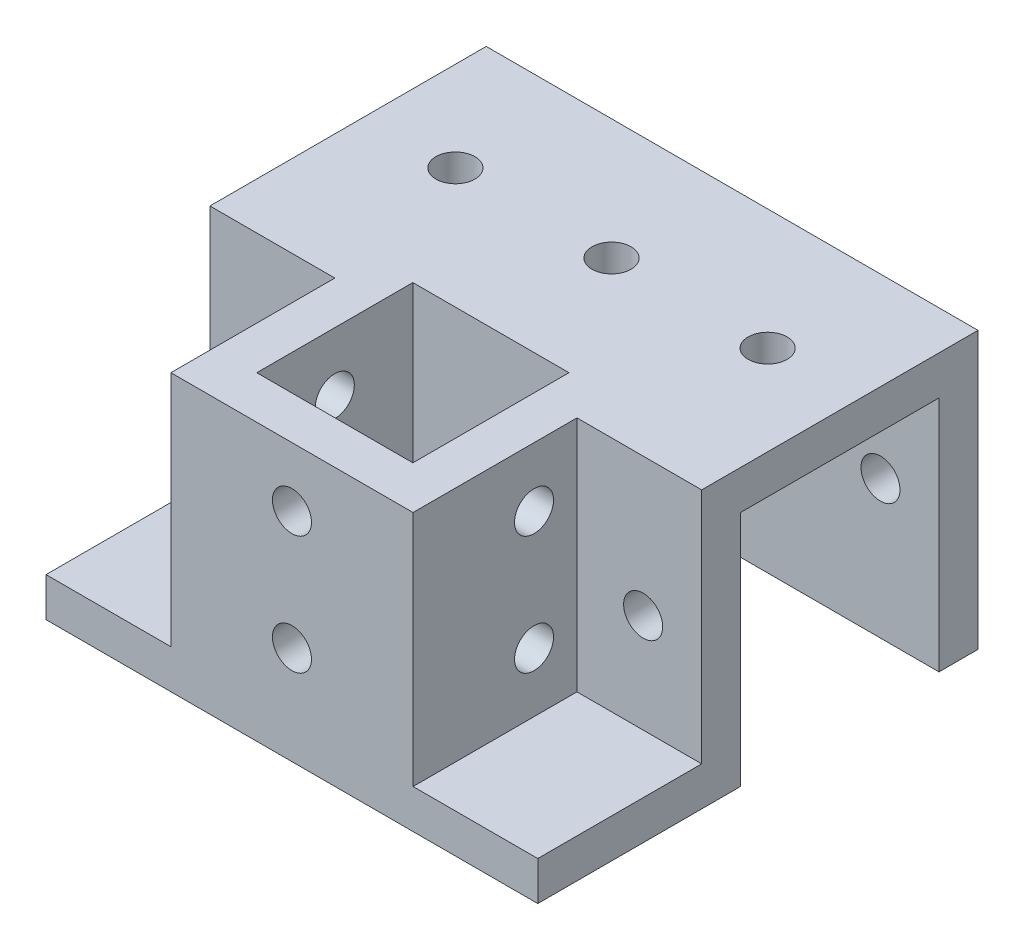
ISO-10303-21;
HEADER;
FILE_DESCRIPTION(('STEP AP214'),'2;1');
FILE_NAME('part.step','',(''),(''),'','','');
FILE_SCHEMA(('AUTOMOTIVE_DESIGN { 1 0 10303 214 1 1 1 1 }'));
ENDSEC;
DATA;
#1=APPLICATION_CONTEXT('core data for automotive mechanical design processes');
#2=APPLICATION_PROTOCOL_DEFINITION('international standard','automotive_design',2000,#1);
#3=PRODUCT_CONTEXT('',#1,'mechanical');
#4=PRODUCT('Part','Part','',(#3));
#5=PRODUCT_RELATED_PRODUCT_CATEGORY('part','',(#4));
#6=PRODUCT_DEFINITION_FORMATION('','',#4);
#7=PRODUCT_DEFINITION_CONTEXT('part definition',#1,'design');
#8=PRODUCT_DEFINITION('design','',#6,#7);
#9=PRODUCT_DEFINITION_SHAPE('','',#8);
#10=(LENGTH_UNIT() NAMED_UNIT(*) SI_UNIT(.MILLI.,.METRE.));
#11=(NAMED_UNIT(*) PLANE_ANGLE_UNIT() SI_UNIT($,.RADIAN.));
#12=(NAMED_UNIT(*) SI_UNIT($,.STERADIAN.) SOLID_ANGLE_UNIT());
#13=UNCERTAINTY_MEASURE_WITH_UNIT(LENGTH_MEASURE(1.E-05),#10,'distance_accuracy_value','');
#14=(GEOMETRIC_REPRESENTATION_CONTEXT(3) GLOBAL_UNCERTAINTY_ASSIGNED_CONTEXT((#13)) GLOBAL_UNIT_ASSIGNED_CONTEXT((#10,
#11,#12)) REPRESENTATION_CONTEXT('',''));
#15=CARTESIAN_POINT('',(0.,0.,0.));
#16=DIRECTION('',(0.,0.,1.));
#17=DIRECTION('',(1.,0.,0.));
#18=AXIS2_PLACEMENT_3D('',#15,#16,#17);
#19=CARTESIAN_POINT('',(21.,12.7,12.7));
#20=DIRECTION('',(0.,0.,1.));
#21=DIRECTION('',(0.,-1.,0.));
#22=AXIS2_PLACEMENT_3D('',#19,#20,#21);
#23=PLANE('',#22);
#24=DIRECTION('',(0.,1.,0.));
#25=VECTOR('',#24,1.);
#26=CARTESIAN_POINT('',(-42.,-17.7,12.7));
#27=LINE('',#26,#25);
#28=CARTESIAN_POINT('',(-42.,-17.7,12.7));
#29=VERTEX_POINT('',#28);
#30=CARTESIAN_POINT('',(-42.,12.7,12.7));
#31=VERTEX_POINT('',#30);
#32=EDGE_CURVE('E384',#29,#31,#27,.T.);
#33=ORIENTED_EDGE('',*,*,#32,.T.);
#34=DIRECTION('',(-1.,0.,0.));
#35=VECTOR('',#34,1.);
#36=CARTESIAN_POINT('',(21.,12.7,12.7));
#37=LINE('',#36,#35);
#38=CARTESIAN_POINT('',(21.,12.7,12.7));
#39=VERTEX_POINT('',#38);
#40=EDGE_CURVE('E242',#39,#31,#37,.T.);
#41=ORIENTED_EDGE('',*,*,#40,.F.);
#42=DIRECTION('',(0.,1.,0.));
#43=VECTOR('',#42,1.);
#44=CARTESIAN_POINT('',(21.,-12.7,12.7));
#45=LINE('',#44,#43);
#46=CARTESIAN_POINT('',(21.,-17.7,12.7));
#47=VERTEX_POINT('',#46);
#48=EDGE_CURVE('E239',#47,#39,#45,.T.);
#49=ORIENTED_EDGE('',*,*,#48,.F.);
#50=DIRECTION('',(-1.,0.,0.));
#51=VECTOR('',#50,1.);
#52=CARTESIAN_POINT('',(21.,-17.7,12.7));
#53=LINE('',#52,#51);
#54=EDGE_CURVE('E244',#47,#29,#53,.T.);
#55=ORIENTED_EDGE('',*,*,#54,.T.);
#56=EDGE_LOOP('',(#33,#41,#49,#55));
#57=FACE_BOUND('',#56,.T.);
#58=CARTESIAN_POINT('',(-34.5,0.,12.7));
#59=DIRECTION('',(0.,0.,1.));
#60=DIRECTION('',(0.,-1.,0.));
#61=AXIS2_PLACEMENT_3D('',#58,#59,#60);
#62=CIRCLE('',#61,2.5);
#63=CARTESIAN_POINT('',(-34.5,-2.50000000000001,12.7));
#64=VERTEX_POINT('',#63);
#65=EDGE_CURVE('E265',#64,#64,#62,.F.);
#66=ORIENTED_EDGE('',*,*,#65,.F.);
#67=EDGE_LOOP('',(#66));
#68=FACE_BOUND('',#67,.T.);
#69=CARTESIAN_POINT('',(13.5,0.,12.7));
#70=DIRECTION('',(0.,0.,1.));
#71=DIRECTION('',(0.,-1.,0.));
#72=AXIS2_PLACEMENT_3D('',#69,#70,#71);
#73=CIRCLE('',#72,2.5);
#74=CARTESIAN_POINT('',(13.5,-2.5,12.7));
#75=VERTEX_POINT('',#74);
#76=EDGE_CURVE('E280',#75,#75,#73,.T.);
#77=ORIENTED_EDGE('',*,*,#76,.T.);
#78=EDGE_LOOP('',(#77));
#79=FACE_BOUND('',#78,.T.);
#80=ADVANCED_FACE('F77',(#57,#68,#79),#23,.F.);
#81=CARTESIAN_POINT('',(21.,17.7,-17.7));
#82=DIRECTION('',(0.,0.,1.));
#83=DIRECTION('',(0.,-1.,0.));
#84=AXIS2_PLACEMENT_3D('',#81,#82,#83);
#85=PLANE('',#84);
#86=DIRECTION('',(-1.,0.,0.));
#87=VECTOR('',#86,1.);
#88=CARTESIAN_POINT('',(21.,-17.7,-17.7));
#89=LINE('',#88,#87);
#90=CARTESIAN_POINT('',(21.,-17.7,-17.7));
#91=VERTEX_POINT('',#90);
#92=CARTESIAN_POINT('',(-42.,-17.7,-17.7));
#93=VERTEX_POINT('',#92);
#94=EDGE_CURVE('E12',#91,#93,#89,.T.);
#95=ORIENTED_EDGE('',*,*,#94,.T.);
#96=DIRECTION('',(0.,1.,0.));
#97=VECTOR('',#96,1.);
#98=CARTESIAN_POINT('',(-42.,12.7,-17.7));
#99=LINE('',#98,#97);
#100=CARTESIAN_POINT('',(-42.,17.7,-17.7));
#101=VERTEX_POINT('',#100);
#102=EDGE_CURVE('E358',#93,#101,#99,.T.);
#103=ORIENTED_EDGE('',*,*,#102,.T.);
#104=DIRECTION('',(-1.,0.,0.));
#105=VECTOR('',#104,1.);
#106=CARTESIAN_POINT('',(21.,17.7,-17.7));
#107=LINE('',#106,#105);
#108=CARTESIAN_POINT('',(21.,17.7,-17.7));
#109=VERTEX_POINT('',#108);
#110=EDGE_CURVE('E86',#109,#101,#107,.T.);
#111=ORIENTED_EDGE('',*,*,#110,.F.);
#112=DIRECTION('',(0.,1.,0.));
#113=VECTOR('',#112,1.);
#114=CARTESIAN_POINT('',(21.,17.7,-17.7));
#115=LINE('',#114,#113);
#116=EDGE_CURVE('E223',#91,#109,#115,.T.);
#117=ORIENTED_EDGE('',*,*,#116,.F.);
#118=EDGE_LOOP('',(#95,#103,#111,#117));
#119=FACE_BOUND('',#118,.T.);
#120=CARTESIAN_POINT('',(-34.5,0.,-17.7));
#121=DIRECTION('',(0.,0.,1.));
#122=DIRECTION('',(0.,-1.,0.));
#123=AXIS2_PLACEMENT_3D('',#120,#121,#122);
#124=CIRCLE('',#123,2.5);
#125=CARTESIAN_POINT('',(-34.5,-2.5,-17.7));
#126=VERTEX_POINT('',#125);
#127=EDGE_CURVE('E268',#126,#126,#124,.T.);
#128=ORIENTED_EDGE('',*,*,#127,.T.);
#129=EDGE_LOOP('',(#128));
#130=FACE_BOUND('',#129,.T.);
#131=CARTESIAN_POINT('',(13.5,0.,-17.7));
#132=DIRECTION('',(0.,0.,-1.));
#133=DIRECTION('',(0.,1.,0.));
#134=AXIS2_PLACEMENT_3D('',#131,#132,#133);
#135=CIRCLE('',#134,2.5);
#136=CARTESIAN_POINT('',(13.5,2.5,-17.7));
#137=VERTEX_POINT('',#136);
#138=EDGE_CURVE('E261',#137,#137,#135,.T.);
#139=ORIENTED_EDGE('',*,*,#138,.F.);
#140=EDGE_LOOP('',(#139));
#141=FACE_BOUND('',#140,.T.);
#142=ADVANCED_FACE('F462',(#119,#130,#141),#85,.F.);
#143=CARTESIAN_POINT('',(0.,0.,38.7));
#144=DIRECTION('',(0.,0.,-1.));
#145=DIRECTION('',(-1.,0.,0.));
#146=AXIS2_PLACEMENT_3D('',#143,#144,#145);
#147=PLANE('',#146);
#148=CARTESIAN_POINT('',(-10.4886848174141,-5.1,38.7));
#149=DIRECTION('',(0.,0.,1.));
#150=DIRECTION('',(1.,0.,0.));
#151=AXIS2_PLACEMENT_3D('',#148,#149,#150);
#152=CIRCLE('',#151,2.5);
#153=CARTESIAN_POINT('',(-7.98868481741409,-5.1,38.7));
#154=VERTEX_POINT('',#153);
#155=EDGE_CURVE('E301',#154,#154,#152,.T.);
#156=ORIENTED_EDGE('',*,*,#155,.F.);
#157=EDGE_LOOP('',(#156));
#158=FACE_BOUND('',#157,.T.);
#159=DIRECTION('',(1.,0.,0.));
#160=VECTOR('',#159,1.);
#161=CARTESIAN_POINT('',(0.,17.7,38.7));
#162=LINE('',#161,#160);
#163=CARTESIAN_POINT('',(-26.,17.7,38.7));
#164=VERTEX_POINT('',#163);
#165=CARTESIAN_POINT('',(5.02263036517181,17.7,38.7));
#166=VERTEX_POINT('',#165);
#167=EDGE_CURVE('E402',#164,#166,#162,.T.);
#168=ORIENTED_EDGE('',*,*,#167,.F.);
#169=DIRECTION('',(0.,1.,0.));
#170=VECTOR('',#169,1.);
#171=CARTESIAN_POINT('',(-26.,17.7,38.7));
#172=LINE('',#171,#170);
#173=CARTESIAN_POINT('',(-26.,-12.7,38.7));
#174=VERTEX_POINT('',#173);
#175=EDGE_CURVE('E393',#174,#164,#172,.T.);
#176=ORIENTED_EDGE('',*,*,#175,.F.);
#177=DIRECTION('',(1.,0.,0.));
#178=VECTOR('',#177,1.);
#179=CARTESIAN_POINT('',(-42.,-12.7,38.7));
#180=LINE('',#179,#178);
#181=CARTESIAN_POINT('',(-42.,-12.7,38.7));
#182=VERTEX_POINT('',#181);
#183=EDGE_CURVE('E389',#182,#174,#180,.T.);
#184=ORIENTED_EDGE('',*,*,#183,.F.);
#185=DIRECTION('',(0.,-1.,0.));
#186=VECTOR('',#185,1.);
#187=CARTESIAN_POINT('',(-42.,-12.7,38.7));
#188=LINE('',#187,#186);
#189=CARTESIAN_POINT('',(-42.,-17.7,38.7));
#190=VERTEX_POINT('',#189);
#191=EDGE_CURVE('E378',#182,#190,#188,.T.);
#192=ORIENTED_EDGE('',*,*,#191,.T.);
#193=DIRECTION('',(1.,0.,0.));
#194=VECTOR('',#193,1.);
#195=CARTESIAN_POINT('',(21.,-17.7,38.7));
#196=LINE('',#195,#194);
#197=CARTESIAN_POINT('',(21.,-17.7,38.7));
#198=VERTEX_POINT('',#197);
#199=EDGE_CURVE('E411',#190,#198,#196,.T.);
#200=ORIENTED_EDGE('',*,*,#199,.T.);
#201=DIRECTION('',(0.,1.,0.));
#202=VECTOR('',#201,1.);
#203=CARTESIAN_POINT('',(21.,-17.7,38.7));
#204=LINE('',#203,#202);
#205=CARTESIAN_POINT('',(21.,-12.7,38.7));
#206=VERTEX_POINT('',#205);
#207=EDGE_CURVE('E414',#198,#206,#204,.T.);
#208=ORIENTED_EDGE('',*,*,#207,.T.);
#209=DIRECTION('',(-1.,0.,0.));
#210=VECTOR('',#209,1.);
#211=CARTESIAN_POINT('',(21.,-12.7,38.7));
#212=LINE('',#211,#210);
#213=CARTESIAN_POINT('',(5.02263036517181,-12.7,38.7));
#214=VERTEX_POINT('',#213);
#215=EDGE_CURVE('E229',#206,#214,#212,.T.);
#216=ORIENTED_EDGE('',*,*,#215,.T.);
#217=DIRECTION('',(0.,-1.,0.));
#218=VECTOR('',#217,1.);
#219=CARTESIAN_POINT('',(5.02263036517181,17.7,38.7));
#220=LINE('',#219,#218);
#221=EDGE_CURVE('E399',#166,#214,#220,.T.);
#222=ORIENTED_EDGE('',*,*,#221,.F.);
#223=EDGE_LOOP('',(#168,#176,#184,#192,#200,#208,#216,#222));
#224=FACE_BOUND('',#223,.T.);
#225=CARTESIAN_POINT('',(-10.4886848174141,10.1,38.7));
#226=DIRECTION('',(0.,0.,1.));
#227=DIRECTION('',(1.,0.,0.));
#228=AXIS2_PLACEMENT_3D('',#225,#226,#227);
#229=CIRCLE('',#228,2.5);
#230=CARTESIAN_POINT('',(-7.98868481741409,10.1,38.7));
#231=VERTEX_POINT('',#230);
#232=EDGE_CURVE('E302',#231,#231,#229,.F.);
#233=ORIENTED_EDGE('',*,*,#232,.T.);
#234=EDGE_LOOP('',(#233));
#235=FACE_BOUND('',#234,.T.);
#236=ADVANCED_FACE('F440',(#158,#224,#235),#147,.F.);
#237=CARTESIAN_POINT('',(-20.5,-42.398484809835,33.2));
#238=DIRECTION('',(0.,0.,1.));
#239=DIRECTION('',(1.,0.,0.));
#240=AXIS2_PLACEMENT_3D('',#237,#238,#239);
#241=PLANE('',#240);
#242=CARTESIAN_POINT('',(-10.4886848174141,-5.1,33.2));
#243=DIRECTION('',(0.,0.,1.));
#244=DIRECTION('',(1.,0.,0.));
#245=AXIS2_PLACEMENT_3D('',#242,#243,#244);
#246=CIRCLE('',#245,2.5);
#247=CARTESIAN_POINT('',(-7.98868481741409,-5.1,33.2));
#248=VERTEX_POINT('',#247);
#249=EDGE_CURVE('E306',#248,#248,#246,.F.);
#250=ORIENTED_EDGE('',*,*,#249,.F.);
#251=EDGE_LOOP('',(#250));
#252=FACE_BOUND('',#251,.T.);
#253=DIRECTION('',(1.,0.,0.));
#254=VECTOR('',#253,1.);
#255=CARTESIAN_POINT('',(-20.5,-12.7,33.2));
#256=LINE('',#255,#254);
#257=CARTESIAN_POINT('',(-20.5,-12.7,33.2));
#258=VERTEX_POINT('',#257);
#259=CARTESIAN_POINT('',(-0.499999999999997,-12.7,33.2));
#260=VERTEX_POINT('',#259);
#261=EDGE_CURVE('E344',#258,#260,#256,.T.);
#262=ORIENTED_EDGE('',*,*,#261,.F.);
#263=DIRECTION('',(0.,1.,0.));
#264=VECTOR('',#263,1.);
#265=CARTESIAN_POINT('',(-20.5,-42.398484809835,33.2));
#266=LINE('',#265,#264);
#267=CARTESIAN_POINT('',(-20.5,17.7,33.2));
#268=VERTEX_POINT('',#267);
#269=EDGE_CURVE('E339',#258,#268,#266,.T.);
#270=ORIENTED_EDGE('',*,*,#269,.T.);
#271=DIRECTION('',(1.,0.,0.));
#272=VECTOR('',#271,1.);
#273=CARTESIAN_POINT('',(-20.5,17.7,33.2));
#274=LINE('',#273,#272);
#275=CARTESIAN_POINT('',(-0.499999999999997,17.7,33.2));
#276=VERTEX_POINT('',#275);
#277=EDGE_CURVE('E333',#268,#276,#274,.T.);
#278=ORIENTED_EDGE('',*,*,#277,.T.);
#279=DIRECTION('',(0.,1.,0.));
#280=VECTOR('',#279,1.);
#281=CARTESIAN_POINT('',(-0.499999999999997,-42.398484809835,33.2));
#282=LINE('',#281,#280);
#283=EDGE_CURVE('E348',#260,#276,#282,.T.);
#284=ORIENTED_EDGE('',*,*,#283,.F.);
#285=EDGE_LOOP('',(#262,#270,#278,#284));
#286=FACE_BOUND('',#285,.T.);
#287=CARTESIAN_POINT('',(-10.4886848174141,10.1,33.2));
#288=DIRECTION('',(0.,0.,1.));
#289=DIRECTION('',(1.,0.,0.));
#290=AXIS2_PLACEMENT_3D('',#287,#288,#289);
#291=CIRCLE('',#290,2.5);
#292=CARTESIAN_POINT('',(-7.98868481741409,10.1,33.2));
#293=VERTEX_POINT('',#292);
#294=EDGE_CURVE('E305',#293,#293,#291,.T.);
#295=ORIENTED_EDGE('',*,*,#294,.T.);
#296=EDGE_LOOP('',(#295));
#297=FACE_BOUND('',#296,.T.);
#298=ADVANCED_FACE('F545',(#252,#286,#297),#241,.F.);
#299=CARTESIAN_POINT('',(-26.,0.,0.));
#300=DIRECTION('',(1.,0.,0.));
#301=DIRECTION('',(0.,0.,-1.));
#302=AXIS2_PLACEMENT_3D('',#299,#300,#301);
#303=PLANE('',#302);
#304=DIRECTION('',(0.,-1.,0.));
#305=VECTOR('',#304,1.);
#306=CARTESIAN_POINT('',(-26.,17.7,17.7));
#307=LINE('',#306,#305);
#308=CARTESIAN_POINT('',(-26.,17.7,17.7));
#309=VERTEX_POINT('',#308);
#310=CARTESIAN_POINT('',(-26.,-12.7,17.7));
#311=VERTEX_POINT('',#310);
#312=EDGE_CURVE('E364',#309,#311,#307,.T.);
#313=ORIENTED_EDGE('',*,*,#312,.T.);
#314=DIRECTION('',(0.,0.,1.));
#315=VECTOR('',#314,1.);
#316=CARTESIAN_POINT('',(-26.,-12.7,12.7));
#317=LINE('',#316,#315);
#318=EDGE_CURVE('E377',#311,#174,#317,.T.);
#319=ORIENTED_EDGE('',*,*,#318,.T.);
#320=ORIENTED_EDGE('',*,*,#175,.T.);
#321=DIRECTION('',(0.,0.,-1.));
#322=VECTOR('',#321,1.);
#323=CARTESIAN_POINT('',(-26.,17.7,12.7));
#324=LINE('',#323,#322);
#325=EDGE_CURVE('E396',#164,#309,#324,.T.);
#326=ORIENTED_EDGE('',*,*,#325,.T.);
#327=EDGE_LOOP('',(#313,#319,#320,#326));
#328=FACE_BOUND('',#327,.T.);
#329=CARTESIAN_POINT('',(-26.,-5.10000000000001,23.2));
#330=DIRECTION('',(1.,0.,0.));
#331=DIRECTION('',(0.,0.,-1.));
#332=AXIS2_PLACEMENT_3D('',#329,#330,#331);
#333=CIRCLE('',#332,2.5);
#334=CARTESIAN_POINT('',(-26.,-5.10000000000001,20.7));
#335=VERTEX_POINT('',#334);
#336=EDGE_CURVE('E317',#335,#335,#333,.T.);
#337=ORIENTED_EDGE('',*,*,#336,.T.);
#338=EDGE_LOOP('',(#337));
#339=FACE_BOUND('',#338,.T.);
#340=CARTESIAN_POINT('',(-26.,10.1,23.2));
#341=DIRECTION('',(1.,0.,0.));
#342=DIRECTION('',(0.,0.,-1.));
#343=AXIS2_PLACEMENT_3D('',#340,#341,#342);
#344=CIRCLE('',#343,2.5);
#345=CARTESIAN_POINT('',(-26.,10.1,20.7));
#346=VERTEX_POINT('',#345);
#347=EDGE_CURVE('E254',#346,#346,#344,.F.);
#348=ORIENTED_EDGE('',*,*,#347,.F.);
#349=EDGE_LOOP('',(#348));
#350=FACE_BOUND('',#349,.T.);
#351=ADVANCED_FACE('F472',(#328,#339,#350),#303,.F.);
#352=CARTESIAN_POINT('',(5.02263036517181,17.7,69.5121212477354));
#353=DIRECTION('',(-1.,0.,0.));
#354=DIRECTION('',(0.,-1.,0.));
#355=AXIS2_PLACEMENT_3D('',#352,#353,#354);
#356=PLANE('',#355);
#357=DIRECTION('',(0.,0.,-1.));
#358=VECTOR('',#357,1.);
#359=CARTESIAN_POINT('',(5.02263036517181,17.7,69.5121212477354));
#360=LINE('',#359,#358);
#361=CARTESIAN_POINT('',(5.02263036517181,17.7,17.7));
#362=VERTEX_POINT('',#361);
#363=EDGE_CURVE('E405',#166,#362,#360,.T.);
#364=ORIENTED_EDGE('',*,*,#363,.F.);
#365=ORIENTED_EDGE('',*,*,#221,.T.);
#366=DIRECTION('',(0.,0.,-1.));
#367=VECTOR('',#366,1.);
#368=CARTESIAN_POINT('',(5.02263036517181,-12.7,69.5121212477354));
#369=LINE('',#368,#367);
#370=CARTESIAN_POINT('',(5.02263036517181,-12.7,17.7));
#371=VERTEX_POINT('',#370);
#372=EDGE_CURVE('E407',#214,#371,#369,.T.);
#373=ORIENTED_EDGE('',*,*,#372,.T.);
#374=DIRECTION('',(0.,1.,0.));
#375=VECTOR('',#374,1.);
#376=CARTESIAN_POINT('',(5.02263036517181,17.7,17.7));
#377=LINE('',#376,#375);
#378=EDGE_CURVE('E398',#371,#362,#377,.T.);
#379=ORIENTED_EDGE('',*,*,#378,.T.);
#380=EDGE_LOOP('',(#364,#365,#373,#379));
#381=FACE_BOUND('',#380,.T.);
#382=CARTESIAN_POINT('',(5.02263036517181,-5.10000000000001,23.2));
#383=DIRECTION('',(1.,0.,0.));
#384=DIRECTION('',(0.,1.,0.));
#385=AXIS2_PLACEMENT_3D('',#382,#383,#384);
#386=CIRCLE('',#385,2.5);
#387=CARTESIAN_POINT('',(5.02263036517181,-2.60000000000001,23.2));
#388=VERTEX_POINT('',#387);
#389=EDGE_CURVE('E309',#388,#388,#386,.F.);
#390=ORIENTED_EDGE('',*,*,#389,.T.);
#391=EDGE_LOOP('',(#390));
#392=FACE_BOUND('',#391,.T.);
#393=CARTESIAN_POINT('',(5.02263036517181,10.1,23.2));
#394=DIRECTION('',(1.,0.,0.));
#395=DIRECTION('',(0.,1.,0.));
#396=AXIS2_PLACEMENT_3D('',#393,#394,#395);
#397=CIRCLE('',#396,2.5);
#398=CARTESIAN_POINT('',(5.02263036517181,12.6,23.2));
#399=VERTEX_POINT('',#398);
#400=EDGE_CURVE('E314',#399,#399,#397,.T.);
#401=ORIENTED_EDGE('',*,*,#400,.F.);
#402=EDGE_LOOP('',(#401));
#403=FACE_BOUND('',#402,.T.);
#404=ADVANCED_FACE('F437',(#381,#392,#403),#356,.F.);
#405=CARTESIAN_POINT('',(-0.5,-42.398484809835,13.2));
#406=DIRECTION('',(-1.,0.,0.));
#407=DIRECTION('',(0.,0.,1.));
#408=AXIS2_PLACEMENT_3D('',#405,#406,#407);
#409=PLANE('',#408);
#410=CARTESIAN_POINT('',(-0.5,-5.10000000000001,23.2));
#411=DIRECTION('',(-1.,0.,0.));
#412=DIRECTION('',(0.,0.,1.));
#413=AXIS2_PLACEMENT_3D('',#410,#411,#412);
#414=CIRCLE('',#413,2.5);
#415=CARTESIAN_POINT('',(-0.5,-5.10000000000001,25.7));
#416=VERTEX_POINT('',#415);
#417=EDGE_CURVE('E253',#416,#416,#414,.F.);
#418=ORIENTED_EDGE('',*,*,#417,.T.);
#419=EDGE_LOOP('',(#418));
#420=FACE_BOUND('',#419,.T.);
#421=DIRECTION('',(0.,1.,0.));
#422=VECTOR('',#421,1.);
#423=CARTESIAN_POINT('',(-0.5,-42.398484809835,13.2));
#424=LINE('',#423,#422);
#425=CARTESIAN_POINT('',(-0.500000000000001,-12.7,13.2));
#426=VERTEX_POINT('',#425);
#427=CARTESIAN_POINT('',(-0.5,17.7,13.2));
#428=VERTEX_POINT('',#427);
#429=EDGE_CURVE('E346',#426,#428,#424,.T.);
#430=ORIENTED_EDGE('',*,*,#429,.F.);
#431=DIRECTION('',(0.,0.,1.));
#432=VECTOR('',#431,1.);
#433=CARTESIAN_POINT('',(-0.5,-12.7,13.2));
#434=LINE('',#433,#432);
#435=EDGE_CURVE('E99',#426,#260,#434,.T.);
#436=ORIENTED_EDGE('',*,*,#435,.T.);
#437=ORIENTED_EDGE('',*,*,#283,.T.);
#438=DIRECTION('',(0.,0.,1.));
#439=VECTOR('',#438,1.);
#440=CARTESIAN_POINT('',(-0.5,17.7,13.2));
#441=LINE('',#440,#439);
#442=EDGE_CURVE('E332',#428,#276,#441,.T.);
#443=ORIENTED_EDGE('',*,*,#442,.F.);
#444=EDGE_LOOP('',(#430,#436,#437,#443));
#445=FACE_BOUND('',#444,.T.);
#446=CARTESIAN_POINT('',(-0.5,10.1,23.2));
#447=DIRECTION('',(-1.,0.,0.));
#448=DIRECTION('',(0.,0.,1.));
#449=AXIS2_PLACEMENT_3D('',#446,#447,#448);
#450=CIRCLE('',#449,2.5);
#451=CARTESIAN_POINT('',(-0.5,10.1,25.7));
#452=VERTEX_POINT('',#451);
#453=EDGE_CURVE('E257',#452,#452,#450,.T.);
#454=ORIENTED_EDGE('',*,*,#453,.F.);
#455=EDGE_LOOP('',(#454));
#456=FACE_BOUND('',#455,.T.);
#457=ADVANCED_FACE('F488',(#420,#445,#456),#409,.T.);
#458=CARTESIAN_POINT('',(-20.5,-42.398484809835,13.2));
#459=DIRECTION('',(-1.,0.,0.));
#460=DIRECTION('',(0.,0.,1.));
#461=AXIS2_PLACEMENT_3D('',#458,#459,#460);
#462=PLANE('',#461);
#463=DIRECTION('',(0.,0.,1.));
#464=VECTOR('',#463,1.);
#465=CARTESIAN_POINT('',(-20.5,-12.7,13.2));
#466=LINE('',#465,#464);
#467=CARTESIAN_POINT('',(-20.5,-12.7,13.2));
#468=VERTEX_POINT('',#467);
#469=EDGE_CURVE('E336',#468,#258,#466,.T.);
#470=ORIENTED_EDGE('',*,*,#469,.F.);
#471=DIRECTION('',(0.,1.,0.));
#472=VECTOR('',#471,1.);
#473=CARTESIAN_POINT('',(-20.5,-42.398484809835,13.2));
#474=LINE('',#473,#472);
#475=CARTESIAN_POINT('',(-20.5,17.7,13.2));
#476=VERTEX_POINT('',#475);
#477=EDGE_CURVE('E328',#468,#476,#474,.T.);
#478=ORIENTED_EDGE('',*,*,#477,.T.);
#479=DIRECTION('',(0.,0.,1.));
#480=VECTOR('',#479,1.);
#481=CARTESIAN_POINT('',(-20.5,17.7,13.2));
#482=LINE('',#481,#480);
#483=EDGE_CURVE('E340',#476,#268,#482,.T.);
#484=ORIENTED_EDGE('',*,*,#483,.T.);
#485=ORIENTED_EDGE('',*,*,#269,.F.);
#486=EDGE_LOOP('',(#470,#478,#484,#485));
#487=FACE_BOUND('',#486,.T.);
#488=CARTESIAN_POINT('',(-20.5,-5.10000000000001,23.2));
#489=DIRECTION('',(-1.,0.,0.));
#490=DIRECTION('',(0.,0.,1.));
#491=AXIS2_PLACEMENT_3D('',#488,#489,#490);
#492=CIRCLE('',#491,2.5);
#493=CARTESIAN_POINT('',(-20.5,-5.10000000000001,25.7));
#494=VERTEX_POINT('',#493);
#495=EDGE_CURVE('E250',#494,#494,#492,.F.);
#496=ORIENTED_EDGE('',*,*,#495,.F.);
#497=EDGE_LOOP('',(#496));
#498=FACE_BOUND('',#497,.T.);
#499=CARTESIAN_POINT('',(-20.5,10.1,23.2));
#500=DIRECTION('',(-1.,0.,0.));
#501=DIRECTION('',(0.,0.,1.));
#502=AXIS2_PLACEMENT_3D('',#499,#500,#501);
#503=CIRCLE('',#502,2.5);
#504=CARTESIAN_POINT('',(-20.5,10.1,25.7));
#505=VERTEX_POINT('',#504);
#506=EDGE_CURVE('E255',#505,#505,#503,.T.);
#507=ORIENTED_EDGE('',*,*,#506,.T.);
#508=EDGE_LOOP('',(#507));
#509=FACE_BOUND('',#508,.T.);
#510=ADVANCED_FACE('F478',(#487,#498,#509),#462,.F.);
#511=CARTESIAN_POINT('',(-42.,-12.7,12.7));
#512=DIRECTION('',(0.,1.,0.));
#513=DIRECTION('',(0.,0.,1.));
#514=AXIS2_PLACEMENT_3D('',#511,#512,#513);
#515=PLANE('',#514);
#516=ORIENTED_EDGE('',*,*,#318,.F.);
#517=DIRECTION('',(-1.,0.,0.));
#518=VECTOR('',#517,1.);
#519=CARTESIAN_POINT('',(-26.,-12.7,17.7));
#520=LINE('',#519,#518);
#521=CARTESIAN_POINT('',(-42.,-12.7,17.7));
#522=VERTEX_POINT('',#521);
#523=EDGE_CURVE('E366',#311,#522,#520,.T.);
#524=ORIENTED_EDGE('',*,*,#523,.T.);
#525=DIRECTION('',(0.,0.,1.));
#526=VECTOR('',#525,1.);
#527=CARTESIAN_POINT('',(-42.,-12.7,12.7));
#528=LINE('',#527,#526);
#529=EDGE_CURVE('E387',#522,#182,#528,.T.);
#530=ORIENTED_EDGE('',*,*,#529,.T.);
#531=ORIENTED_EDGE('',*,*,#183,.T.);
#532=EDGE_LOOP('',(#516,#524,#530,#531));
#533=FACE_BOUND('',#532,.T.);
#534=ADVANCED_FACE('F475',(#533),#515,.T.);
#535=CARTESIAN_POINT('',(21.,17.7,17.7));
#536=DIRECTION('',(0.,0.,-1.));
#537=DIRECTION('',(0.,1.,0.));
#538=AXIS2_PLACEMENT_3D('',#535,#536,#537);
#539=PLANE('',#538);
#540=CARTESIAN_POINT('',(13.5,0.,17.7));
#541=DIRECTION('',(0.,0.,-1.));
#542=DIRECTION('',(0.,1.,0.));
#543=AXIS2_PLACEMENT_3D('',#540,#541,#542);
#544=CIRCLE('',#543,2.5);
#545=CARTESIAN_POINT('',(13.5,2.5,17.7));
#546=VERTEX_POINT('',#545);
#547=EDGE_CURVE('E277',#546,#546,#544,.T.);
#548=ORIENTED_EDGE('',*,*,#547,.T.);
#549=EDGE_LOOP('',(#548));
#550=FACE_BOUND('',#549,.T.);
#551=ORIENTED_EDGE('',*,*,#378,.F.);
#552=DIRECTION('',(-1.,0.,0.));
#553=VECTOR('',#552,1.);
#554=CARTESIAN_POINT('',(21.,-12.7,17.7));
#555=LINE('',#554,#553);
#556=CARTESIAN_POINT('',(21.,-12.7,17.7));
#557=VERTEX_POINT('',#556);
#558=EDGE_CURVE('E401',#557,#371,#555,.T.);
#559=ORIENTED_EDGE('',*,*,#558,.F.);
#560=DIRECTION('',(0.,-1.,0.));
#561=VECTOR('',#560,1.);
#562=CARTESIAN_POINT('',(21.,17.7,17.7));
#563=LINE('',#562,#561);
#564=CARTESIAN_POINT('',(21.,17.7,17.7));
#565=VERTEX_POINT('',#564);
#566=EDGE_CURVE('E234',#565,#557,#563,.T.);
#567=ORIENTED_EDGE('',*,*,#566,.F.);
#568=DIRECTION('',(-1.,0.,0.));
#569=VECTOR('',#568,1.);
#570=CARTESIAN_POINT('',(21.,17.7,17.7));
#571=LINE('',#570,#569);
#572=EDGE_CURVE('E246',#565,#362,#571,.T.);
#573=ORIENTED_EDGE('',*,*,#572,.T.);
#574=EDGE_LOOP('',(#551,#559,#567,#573));
#575=FACE_BOUND('',#574,.T.);
#576=ADVANCED_FACE('F426',(#550,#575),#539,.F.);
#577=CARTESIAN_POINT('',(21.,-12.7,38.7));
#578=DIRECTION('',(0.,-1.,0.));
#579=DIRECTION('',(1.,0.,0.));
#580=AXIS2_PLACEMENT_3D('',#577,#578,#579);
#581=PLANE('',#580);
#582=ORIENTED_EDGE('',*,*,#372,.F.);
#583=ORIENTED_EDGE('',*,*,#215,.F.);
#584=DIRECTION('',(0.,0.,-1.));
#585=VECTOR('',#584,1.);
#586=CARTESIAN_POINT('',(21.,-12.7,38.7));
#587=LINE('',#586,#585);
#588=EDGE_CURVE('E224',#206,#557,#587,.T.);
#589=ORIENTED_EDGE('',*,*,#588,.T.);
#590=ORIENTED_EDGE('',*,*,#558,.T.);
#591=EDGE_LOOP('',(#582,#583,#589,#590));
#592=FACE_BOUND('',#591,.T.);
#593=ADVANCED_FACE('F420',(#592),#581,.F.);
#594=CARTESIAN_POINT('',(21.,-17.7,-12.7));
#595=DIRECTION('',(0.,1.,0.));
#596=DIRECTION('',(0.,0.,1.));
#597=AXIS2_PLACEMENT_3D('',#594,#595,#596);
#598=PLANE('',#597);
#599=DIRECTION('',(0.,0.,-1.));
#600=VECTOR('',#599,1.);
#601=CARTESIAN_POINT('',(21.,-17.7,-12.7));
#602=LINE('',#601,#600);
#603=CARTESIAN_POINT('',(21.,-17.7,-12.7062548736583));
#604=VERTEX_POINT('',#603);
#605=EDGE_CURVE('E216',#604,#91,#602,.T.);
#606=ORIENTED_EDGE('',*,*,#605,.F.);
#607=DIRECTION('',(-1.,0.,0.));
#608=VECTOR('',#607,1.);
#609=CARTESIAN_POINT('',(-21.,-17.7,-12.7062548736583));
#610=LINE('',#609,#608);
#611=CARTESIAN_POINT('',(-42.,-17.7,-12.7062548736583));
#612=VERTEX_POINT('',#611);
#613=EDGE_CURVE('E201',#604,#612,#610,.T.);
#614=ORIENTED_EDGE('',*,*,#613,.T.);
#615=DIRECTION('',(0.,0.,-1.));
#616=VECTOR('',#615,1.);
#617=CARTESIAN_POINT('',(-42.,-17.7,-12.7062548736583));
#618=LINE('',#617,#616);
#619=EDGE_CURVE('E212',#612,#93,#618,.T.);
#620=ORIENTED_EDGE('',*,*,#619,.T.);
#621=ORIENTED_EDGE('',*,*,#94,.F.);
#622=EDGE_LOOP('',(#606,#614,#620,#621));
#623=FACE_BOUND('',#622,.T.);
#624=ADVANCED_FACE('F79',(#623),#598,.F.);
#625=CARTESIAN_POINT('',(21.,17.7,17.7));
#626=DIRECTION('',(0.,-1.,0.));
#627=DIRECTION('',(0.,0.,-1.));
#628=AXIS2_PLACEMENT_3D('',#625,#626,#627);
#629=PLANE('',#628);
#630=CARTESIAN_POINT('',(-30.5,17.7,-2.24999999999986));
#631=DIRECTION('',(0.,1.,0.));
#632=DIRECTION('',(0.,0.,1.));
#633=AXIS2_PLACEMENT_3D('',#630,#631,#632);
#634=CIRCLE('',#633,2.5);
#635=CARTESIAN_POINT('',(-30.5,17.7,0.250000000000142));
#636=VERTEX_POINT('',#635);
#637=EDGE_CURVE('E288',#636,#636,#634,.T.);
#638=ORIENTED_EDGE('',*,*,#637,.F.);
#639=EDGE_LOOP('',(#638));
#640=FACE_BOUND('',#639,.T.);
#641=CARTESIAN_POINT('',(9.5,17.7,-2.25));
#642=DIRECTION('',(0.,1.,0.));
#643=DIRECTION('',(0.,0.,1.));
#644=AXIS2_PLACEMENT_3D('',#641,#642,#643);
#645=CIRCLE('',#644,2.5);
#646=CARTESIAN_POINT('',(9.5,17.7,0.25));
#647=VERTEX_POINT('',#646);
#648=EDGE_CURVE('E287',#647,#647,#645,.T.);
#649=ORIENTED_EDGE('',*,*,#648,.F.);
#650=EDGE_LOOP('',(#649));
#651=FACE_BOUND('',#650,.T.);
#652=CARTESIAN_POINT('',(-10.5,17.7,-2.25));
#653=DIRECTION('',(0.,1.,0.));
#654=DIRECTION('',(0.,0.,1.));
#655=AXIS2_PLACEMENT_3D('',#652,#653,#654);
#656=CIRCLE('',#655,2.5);
#657=CARTESIAN_POINT('',(-10.5,17.7,0.25));
#658=VERTEX_POINT('',#657);
#659=EDGE_CURVE('E291',#658,#658,#656,.T.);
#660=ORIENTED_EDGE('',*,*,#659,.F.);
#661=EDGE_LOOP('',(#660));
#662=FACE_BOUND('',#661,.T.);
#663=ORIENTED_EDGE('',*,*,#110,.T.);
#664=DIRECTION('',(0.,0.,-1.));
#665=VECTOR('',#664,1.);
#666=CARTESIAN_POINT('',(-42.,17.7,17.7));
#667=LINE('',#666,#665);
#668=CARTESIAN_POINT('',(-42.,17.7,17.7));
#669=VERTEX_POINT('',#668);
#670=EDGE_CURVE('E374',#669,#101,#667,.T.);
#671=ORIENTED_EDGE('',*,*,#670,.F.);
#672=DIRECTION('',(-1.,0.,0.));
#673=VECTOR('',#672,1.);
#674=CARTESIAN_POINT('',(-26.,17.7,17.7));
#675=LINE('',#674,#673);
#676=EDGE_CURVE('E372',#309,#669,#675,.T.);
#677=ORIENTED_EDGE('',*,*,#676,.F.);
#678=ORIENTED_EDGE('',*,*,#325,.F.);
#679=ORIENTED_EDGE('',*,*,#167,.T.);
#680=ORIENTED_EDGE('',*,*,#363,.T.);
#681=ORIENTED_EDGE('',*,*,#572,.F.);
#682=DIRECTION('',(0.,0.,1.));
#683=VECTOR('',#682,1.);
#684=CARTESIAN_POINT('',(21.,17.7,17.7));
#685=LINE('',#684,#683);
#686=EDGE_CURVE('E226',#109,#565,#685,.T.);
#687=ORIENTED_EDGE('',*,*,#686,.F.);
#688=EDGE_LOOP('',(#663,#671,#677,#678,#679,#680,#681,#687));
#689=FACE_BOUND('',#688,.T.);
#690=ORIENTED_EDGE('',*,*,#277,.F.);
#691=ORIENTED_EDGE('',*,*,#483,.F.);
#692=DIRECTION('',(1.,0.,0.));
#693=VECTOR('',#692,1.);
#694=CARTESIAN_POINT('',(-20.5,17.7,13.2));
#695=LINE('',#694,#693);
#696=EDGE_CURVE('E329',#476,#428,#695,.T.);
#697=ORIENTED_EDGE('',*,*,#696,.T.);
#698=ORIENTED_EDGE('',*,*,#442,.T.);
#699=EDGE_LOOP('',(#690,#691,#697,#698));
#700=FACE_BOUND('',#699,.T.);
#701=ADVANCED_FACE('F432',(#640,#651,#662,#689,#700),#629,.F.);
#702=CARTESIAN_POINT('',(21.,-17.7,12.7));
#703=DIRECTION('',(0.,1.,0.));
#704=DIRECTION('',(0.,0.,1.));
#705=AXIS2_PLACEMENT_3D('',#702,#703,#704);
#706=PLANE('',#705);
#707=ORIENTED_EDGE('',*,*,#199,.F.);
#708=DIRECTION('',(0.,0.,-1.));
#709=VECTOR('',#708,1.);
#710=CARTESIAN_POINT('',(-42.,-17.7,38.7));
#711=LINE('',#710,#709);
#712=EDGE_CURVE('E381',#190,#29,#711,.T.);
#713=ORIENTED_EDGE('',*,*,#712,.T.);
#714=ORIENTED_EDGE('',*,*,#54,.F.);
#715=DIRECTION('',(0.,0.,-1.));
#716=VECTOR('',#715,1.);
#717=CARTESIAN_POINT('',(21.,-17.7,12.7));
#718=LINE('',#717,#716);
#719=EDGE_CURVE('E237',#198,#47,#718,.T.);
#720=ORIENTED_EDGE('',*,*,#719,.F.);
#721=EDGE_LOOP('',(#707,#713,#714,#720));
#722=FACE_BOUND('',#721,.T.);
#723=ADVANCED_FACE('F447',(#722),#706,.F.);
#724=CARTESIAN_POINT('',(21.,12.7,12.7));
#725=DIRECTION('',(0.,1.,0.));
#726=DIRECTION('',(0.,0.,1.));
#727=AXIS2_PLACEMENT_3D('',#724,#725,#726);
#728=PLANE('',#727);
#729=DIRECTION('',(-1.,0.,0.));
#730=VECTOR('',#729,1.);
#731=CARTESIAN_POINT('',(-21.,12.7,-12.7062548736583));
#732=LINE('',#731,#730);
#733=CARTESIAN_POINT('',(21.,12.7,-12.7062548736583));
#734=VERTEX_POINT('',#733);
#735=CARTESIAN_POINT('',(-42.,12.7,-12.7062548736583));
#736=VERTEX_POINT('',#735);
#737=EDGE_CURVE('E350',#734,#736,#732,.T.);
#738=ORIENTED_EDGE('',*,*,#737,.F.);
#739=DIRECTION('',(0.,0.,-1.));
#740=VECTOR('',#739,1.);
#741=CARTESIAN_POINT('',(21.,12.7,12.7));
#742=LINE('',#741,#740);
#743=EDGE_CURVE('E219',#39,#734,#742,.T.);
#744=ORIENTED_EDGE('',*,*,#743,.F.);
#745=ORIENTED_EDGE('',*,*,#40,.T.);
#746=DIRECTION('',(0.,0.,1.));
#747=VECTOR('',#746,1.);
#748=CARTESIAN_POINT('',(-42.,12.7,-17.7));
#749=LINE('',#748,#747);
#750=EDGE_CURVE('E361',#736,#31,#749,.T.);
#751=ORIENTED_EDGE('',*,*,#750,.F.);
#752=EDGE_LOOP('',(#738,#744,#745,#751));
#753=FACE_BOUND('',#752,.T.);
#754=CARTESIAN_POINT('',(-30.5,12.7,-2.24999999999986));
#755=DIRECTION('',(0.,1.,0.));
#756=DIRECTION('',(0.,0.,1.));
#757=AXIS2_PLACEMENT_3D('',#754,#755,#756);
#758=CIRCLE('',#757,2.5);
#759=CARTESIAN_POINT('',(-30.5,12.7,0.250000000000142));
#760=VERTEX_POINT('',#759);
#761=EDGE_CURVE('E283',#760,#760,#758,.F.);
#762=ORIENTED_EDGE('',*,*,#761,.F.);
#763=EDGE_LOOP('',(#762));
#764=FACE_BOUND('',#763,.T.);
#765=CARTESIAN_POINT('',(9.5,12.7,-2.25));
#766=DIRECTION('',(0.,1.,0.));
#767=DIRECTION('',(0.,0.,1.));
#768=AXIS2_PLACEMENT_3D('',#765,#766,#767);
#769=CIRCLE('',#768,2.5);
#770=CARTESIAN_POINT('',(9.5,12.7,0.25));
#771=VERTEX_POINT('',#770);
#772=EDGE_CURVE('E284',#771,#771,#769,.F.);
#773=ORIENTED_EDGE('',*,*,#772,.F.);
#774=EDGE_LOOP('',(#773));
#775=FACE_BOUND('',#774,.T.);
#776=CARTESIAN_POINT('',(-10.5,12.7,-2.25));
#777=DIRECTION('',(0.,1.,0.));
#778=DIRECTION('',(0.,0.,1.));
#779=AXIS2_PLACEMENT_3D('',#776,#777,#778);
#780=CIRCLE('',#779,2.5);
#781=CARTESIAN_POINT('',(-10.5,12.7,0.25));
#782=VERTEX_POINT('',#781);
#783=EDGE_CURVE('E298',#782,#782,#780,.F.);
#784=ORIENTED_EDGE('',*,*,#783,.F.);
#785=EDGE_LOOP('',(#784));
#786=FACE_BOUND('',#785,.T.);
#787=ADVANCED_FACE('F454',(#753,#764,#775,#786),#728,.F.);
#788=CARTESIAN_POINT('',(21.,0.,0.));
#789=DIRECTION('',(1.,0.,0.));
#790=DIRECTION('',(0.,0.,-1.));
#791=AXIS2_PLACEMENT_3D('',#788,#789,#790);
#792=PLANE('',#791);
#793=DIRECTION('',(0.,1.,0.));
#794=VECTOR('',#793,1.);
#795=CARTESIAN_POINT('',(21.,12.7,-12.7062548736583));
#796=LINE('',#795,#794);
#797=EDGE_CURVE('E205',#604,#734,#796,.T.);
#798=ORIENTED_EDGE('',*,*,#797,.F.);
#799=ORIENTED_EDGE('',*,*,#605,.T.);
#800=ORIENTED_EDGE('',*,*,#116,.T.);
#801=ORIENTED_EDGE('',*,*,#686,.T.);
#802=ORIENTED_EDGE('',*,*,#566,.T.);
#803=ORIENTED_EDGE('',*,*,#588,.F.);
#804=ORIENTED_EDGE('',*,*,#207,.F.);
#805=ORIENTED_EDGE('',*,*,#719,.T.);
#806=ORIENTED_EDGE('',*,*,#48,.T.);
#807=ORIENTED_EDGE('',*,*,#743,.T.);
#808=EDGE_LOOP('',(#798,#799,#800,#801,#802,#803,#804,#805,#806,#807));
#809=FACE_BOUND('',#808,.T.);
#810=ADVANCED_FACE('F215',(#809),#792,.T.);
#811=CARTESIAN_POINT('',(-42.,0.,0.));
#812=DIRECTION('',(1.,0.,0.));
#813=DIRECTION('',(0.,0.,-1.));
#814=AXIS2_PLACEMENT_3D('',#811,#812,#813);
#815=PLANE('',#814);
#816=ORIENTED_EDGE('',*,*,#191,.F.);
#817=ORIENTED_EDGE('',*,*,#529,.F.);
#818=DIRECTION('',(0.,1.,0.));
#819=VECTOR('',#818,1.);
#820=CARTESIAN_POINT('',(-42.,-12.7,17.7));
#821=LINE('',#820,#819);
#822=EDGE_CURVE('E369',#522,#669,#821,.T.);
#823=ORIENTED_EDGE('',*,*,#822,.T.);
#824=ORIENTED_EDGE('',*,*,#670,.T.);
#825=ORIENTED_EDGE('',*,*,#102,.F.);
#826=ORIENTED_EDGE('',*,*,#619,.F.);
#827=DIRECTION('',(0.,1.,0.));
#828=VECTOR('',#827,1.);
#829=CARTESIAN_POINT('',(-42.,-17.7,-12.7062548736583));
#830=LINE('',#829,#828);
#831=EDGE_CURVE('E207',#612,#736,#830,.T.);
#832=ORIENTED_EDGE('',*,*,#831,.T.);
#833=ORIENTED_EDGE('',*,*,#750,.T.);
#834=ORIENTED_EDGE('',*,*,#32,.F.);
#835=ORIENTED_EDGE('',*,*,#712,.F.);
#836=EDGE_LOOP('',(#816,#817,#823,#824,#825,#826,#832,#833,#834,#835));
#837=FACE_BOUND('',#836,.T.);
#838=ADVANCED_FACE('F458',(#837),#815,.F.);
#839=CARTESIAN_POINT('',(0.,0.,17.7));
#840=DIRECTION('',(0.,0.,-1.));
#841=DIRECTION('',(0.,1.,0.));
#842=AXIS2_PLACEMENT_3D('',#839,#840,#841);
#843=PLANE('',#842);
#844=CARTESIAN_POINT('',(-34.5,0.,17.7));
#845=DIRECTION('',(0.,0.,-1.));
#846=DIRECTION('',(0.,1.,0.));
#847=AXIS2_PLACEMENT_3D('',#844,#845,#846);
#848=CIRCLE('',#847,2.5);
#849=CARTESIAN_POINT('',(-34.5,2.5,17.7));
#850=VERTEX_POINT('',#849);
#851=EDGE_CURVE('E260',#850,#850,#848,.F.);
#852=ORIENTED_EDGE('',*,*,#851,.F.);
#853=EDGE_LOOP('',(#852));
#854=FACE_BOUND('',#853,.T.);
#855=ORIENTED_EDGE('',*,*,#312,.F.);
#856=ORIENTED_EDGE('',*,*,#676,.T.);
#857=ORIENTED_EDGE('',*,*,#822,.F.);
#858=ORIENTED_EDGE('',*,*,#523,.F.);
#859=EDGE_LOOP('',(#855,#856,#857,#858));
#860=FACE_BOUND('',#859,.T.);
#861=ADVANCED_FACE('F469',(#854,#860),#843,.F.);
#862=CARTESIAN_POINT('',(-21.,-17.7,-12.7062548736583));
#863=DIRECTION('',(0.,0.,-1.));
#864=DIRECTION('',(0.,1.,0.));
#865=AXIS2_PLACEMENT_3D('',#862,#863,#864);
#866=PLANE('',#865);
#867=CARTESIAN_POINT('',(-34.5,0.,-12.7062548736583));
#868=DIRECTION('',(0.,0.,-1.));
#869=DIRECTION('',(0.,1.,0.));
#870=AXIS2_PLACEMENT_3D('',#867,#868,#869);
#871=CIRCLE('',#870,2.5);
#872=CARTESIAN_POINT('',(-34.5,2.5,-12.7062548736583));
#873=VERTEX_POINT('',#872);
#874=EDGE_CURVE('E258',#873,#873,#871,.F.);
#875=ORIENTED_EDGE('',*,*,#874,.F.);
#876=EDGE_LOOP('',(#875));
#877=FACE_BOUND('',#876,.T.);
#878=ORIENTED_EDGE('',*,*,#737,.T.);
#879=ORIENTED_EDGE('',*,*,#831,.F.);
#880=ORIENTED_EDGE('',*,*,#613,.F.);
#881=ORIENTED_EDGE('',*,*,#797,.T.);
#882=EDGE_LOOP('',(#878,#879,#880,#881));
#883=FACE_BOUND('',#882,.T.);
#884=CARTESIAN_POINT('',(13.5,0.,-12.7062548736583));
#885=DIRECTION('',(0.,0.,-1.));
#886=DIRECTION('',(0.,1.,0.));
#887=AXIS2_PLACEMENT_3D('',#884,#885,#886);
#888=CIRCLE('',#887,2.5);
#889=CARTESIAN_POINT('',(13.5,2.5,-12.7062548736583));
#890=VERTEX_POINT('',#889);
#891=EDGE_CURVE('E81',#890,#890,#888,.F.);
#892=ORIENTED_EDGE('',*,*,#891,.F.);
#893=EDGE_LOOP('',(#892));
#894=FACE_BOUND('',#893,.T.);
#895=ADVANCED_FACE('F203',(#877,#883,#894),#866,.F.);
#896=CARTESIAN_POINT('',(-20.5,-42.398484809835,13.2));
#897=DIRECTION('',(0.,0.,1.));
#898=DIRECTION('',(1.,0.,0.));
#899=AXIS2_PLACEMENT_3D('',#896,#897,#898);
#900=PLANE('',#899);
#901=ORIENTED_EDGE('',*,*,#477,.F.);
#902=DIRECTION('',(1.,0.,0.));
#903=VECTOR('',#902,1.);
#904=CARTESIAN_POINT('',(-20.5,-12.7,13.2));
#905=LINE('',#904,#903);
#906=EDGE_CURVE('E94',#468,#426,#905,.T.);
#907=ORIENTED_EDGE('',*,*,#906,.T.);
#908=ORIENTED_EDGE('',*,*,#429,.T.);
#909=ORIENTED_EDGE('',*,*,#696,.F.);
#910=EDGE_LOOP('',(#901,#907,#908,#909));
#911=FACE_BOUND('',#910,.T.);
#912=ADVANCED_FACE('F552',(#911),#900,.T.);
#913=ORIENTED_EDGE('',*,*,#469,.T.);
#914=ORIENTED_EDGE('',*,*,#261,.T.);
#915=ORIENTED_EDGE('',*,*,#435,.F.);
#916=ORIENTED_EDGE('',*,*,#906,.F.);
#917=EDGE_LOOP('',(#913,#914,#915,#916));
#918=FACE_BOUND('',#917,.T.);
#919=ADVANCED_FACE('F554',(#918),#581,.F.);
#920=CARTESIAN_POINT('',(-33.0710678118655,-5.10000000000001,23.2));
#921=DIRECTION('',(1.,0.,0.));
#922=DIRECTION('',(0.,1.,0.));
#923=AXIS2_PLACEMENT_3D('',#920,#921,#922);
#924=CYLINDRICAL_SURFACE('',#923,2.5);
#925=ORIENTED_EDGE('',*,*,#336,.F.);
#926=EDGE_LOOP('',(#925));
#927=FACE_BOUND('',#926,.T.);
#928=ORIENTED_EDGE('',*,*,#495,.T.);
#929=EDGE_LOOP('',(#928));
#930=FACE_BOUND('',#929,.T.);
#931=ADVANCED_FACE('F544',(#927,#930),#924,.F.);
#932=CARTESIAN_POINT('',(-33.0710678118655,10.1,23.2));
#933=DIRECTION('',(1.,0.,0.));
#934=DIRECTION('',(0.,1.,0.));
#935=AXIS2_PLACEMENT_3D('',#932,#933,#934);
#936=CYLINDRICAL_SURFACE('',#935,2.5);
#937=ORIENTED_EDGE('',*,*,#347,.T.);
#938=EDGE_LOOP('',(#937));
#939=FACE_BOUND('',#938,.T.);
#940=ORIENTED_EDGE('',*,*,#506,.F.);
#941=EDGE_LOOP('',(#940));
#942=FACE_BOUND('',#941,.T.);
#943=ADVANCED_FACE('F540',(#939,#942),#936,.F.);
#944=ORIENTED_EDGE('',*,*,#417,.F.);
#945=EDGE_LOOP('',(#944));
#946=FACE_BOUND('',#945,.T.);
#947=ORIENTED_EDGE('',*,*,#389,.F.);
#948=EDGE_LOOP('',(#947));
#949=FACE_BOUND('',#948,.T.);
#950=ADVANCED_FACE('F538',(#946,#949),#924,.F.);
#951=ORIENTED_EDGE('',*,*,#453,.T.);
#952=EDGE_LOOP('',(#951));
#953=FACE_BOUND('',#952,.T.);
#954=ORIENTED_EDGE('',*,*,#400,.T.);
#955=EDGE_LOOP('',(#954));
#956=FACE_BOUND('',#955,.T.);
#957=ADVANCED_FACE('F534',(#953,#956),#936,.F.);
#958=CARTESIAN_POINT('',(-10.4886848174141,-5.1,26.1289321881345));
#959=DIRECTION('',(0.,0.,1.));
#960=DIRECTION('',(1.,0.,0.));
#961=AXIS2_PLACEMENT_3D('',#958,#959,#960);
#962=CYLINDRICAL_SURFACE('',#961,2.5);
#963=ORIENTED_EDGE('',*,*,#249,.T.);
#964=EDGE_LOOP('',(#963));
#965=FACE_BOUND('',#964,.T.);
#966=ORIENTED_EDGE('',*,*,#155,.T.);
#967=EDGE_LOOP('',(#966));
#968=FACE_BOUND('',#967,.T.);
#969=ADVANCED_FACE('F527',(#965,#968),#962,.F.);
#970=CARTESIAN_POINT('',(-10.4886848174141,10.1,26.1289321881345));
#971=DIRECTION('',(0.,0.,1.));
#972=DIRECTION('',(1.,0.,0.));
#973=AXIS2_PLACEMENT_3D('',#970,#971,#972);
#974=CYLINDRICAL_SURFACE('',#973,2.5);
#975=ORIENTED_EDGE('',*,*,#294,.F.);
#976=EDGE_LOOP('',(#975));
#977=FACE_BOUND('',#976,.T.);
#978=ORIENTED_EDGE('',*,*,#232,.F.);
#979=EDGE_LOOP('',(#978));
#980=FACE_BOUND('',#979,.T.);
#981=ADVANCED_FACE('F518',(#977,#980),#974,.F.);
#982=CARTESIAN_POINT('',(-10.5,5.62893218813452,-2.25));
#983=DIRECTION('',(0.,1.,0.));
#984=DIRECTION('',(0.,0.,1.));
#985=AXIS2_PLACEMENT_3D('',#982,#983,#984);
#986=CYLINDRICAL_SURFACE('',#985,2.5);
#987=ORIENTED_EDGE('',*,*,#783,.T.);
#988=EDGE_LOOP('',(#987));
#989=FACE_BOUND('',#988,.T.);
#990=ORIENTED_EDGE('',*,*,#659,.T.);
#991=EDGE_LOOP('',(#990));
#992=FACE_BOUND('',#991,.T.);
#993=ADVANCED_FACE('F516',(#989,#992),#986,.F.);
#994=CARTESIAN_POINT('',(9.5,5.62893218813452,-2.25));
#995=DIRECTION('',(0.,1.,0.));
#996=DIRECTION('',(0.,0.,1.));
#997=AXIS2_PLACEMENT_3D('',#994,#995,#996);
#998=CYLINDRICAL_SURFACE('',#997,2.5);
#999=ORIENTED_EDGE('',*,*,#772,.T.);
#1000=EDGE_LOOP('',(#999));
#1001=FACE_BOUND('',#1000,.T.);
#1002=ORIENTED_EDGE('',*,*,#648,.T.);
#1003=EDGE_LOOP('',(#1002));
#1004=FACE_BOUND('',#1003,.T.);
#1005=ADVANCED_FACE('F517',(#1001,#1004),#998,.F.);
#1006=CARTESIAN_POINT('',(-30.5,5.62893218813452,-2.24999999999986));
#1007=DIRECTION('',(0.,1.,0.));
#1008=DIRECTION('',(0.,0.,1.));
#1009=AXIS2_PLACEMENT_3D('',#1006,#1007,#1008);
#1010=CYLINDRICAL_SURFACE('',#1009,2.5);
#1011=ORIENTED_EDGE('',*,*,#761,.T.);
#1012=EDGE_LOOP('',(#1011));
#1013=FACE_BOUND('',#1012,.T.);
#1014=ORIENTED_EDGE('',*,*,#637,.T.);
#1015=EDGE_LOOP('',(#1014));
#1016=FACE_BOUND('',#1015,.T.);
#1017=ADVANCED_FACE('F524',(#1013,#1016),#1010,.F.);
#1018=CARTESIAN_POINT('',(-34.5,0.,38.7));
#1019=DIRECTION('',(0.,0.,-1.));
#1020=DIRECTION('',(0.,1.,0.));
#1021=AXIS2_PLACEMENT_3D('',#1018,#1019,#1020);
#1022=CYLINDRICAL_SURFACE('',#1021,2.5);
#1023=ORIENTED_EDGE('',*,*,#127,.F.);
#1024=EDGE_LOOP('',(#1023));
#1025=FACE_BOUND('',#1024,.T.);
#1026=ORIENTED_EDGE('',*,*,#874,.T.);
#1027=EDGE_LOOP('',(#1026));
#1028=FACE_BOUND('',#1027,.T.);
#1029=ADVANCED_FACE('F655',(#1025,#1028),#1022,.F.);
#1030=ORIENTED_EDGE('',*,*,#851,.T.);
#1031=EDGE_LOOP('',(#1030));
#1032=FACE_BOUND('',#1031,.T.);
#1033=ORIENTED_EDGE('',*,*,#65,.T.);
#1034=EDGE_LOOP('',(#1033));
#1035=FACE_BOUND('',#1034,.T.);
#1036=ADVANCED_FACE('F706',(#1032,#1035),#1022,.F.);
#1037=CARTESIAN_POINT('',(13.5,0.,38.7));
#1038=DIRECTION('',(0.,0.,-1.));
#1039=DIRECTION('',(0.,1.,0.));
#1040=AXIS2_PLACEMENT_3D('',#1037,#1038,#1039);
#1041=CYLINDRICAL_SURFACE('',#1040,2.5);
#1042=ORIENTED_EDGE('',*,*,#891,.T.);
#1043=EDGE_LOOP('',(#1042));
#1044=FACE_BOUND('',#1043,.T.);
#1045=ORIENTED_EDGE('',*,*,#138,.T.);
#1046=EDGE_LOOP('',(#1045));
#1047=FACE_BOUND('',#1046,.T.);
#1048=ADVANCED_FACE('F716',(#1044,#1047),#1041,.F.);
#1049=ORIENTED_EDGE('',*,*,#547,.F.);
#1050=EDGE_LOOP('',(#1049));
#1051=FACE_BOUND('',#1050,.T.);
#1052=ORIENTED_EDGE('',*,*,#76,.F.);
#1053=EDGE_LOOP('',(#1052));
#1054=FACE_BOUND('',#1053,.T.);
#1055=ADVANCED_FACE('F726',(#1051,#1054),#1041,.F.);
#1056=CLOSED_SHELL('',(#80,#142,#236,#298,#351,#404,#457,#510,#534,#576,#593,#624,#701,#723,
#787,#810,#838,#861,#895,#912,#919,#931,#943,#950,#957,#969,#981,#993,#1005,#1017,#1029,#1036,
#1048,#1055));
#1057=MANIFOLD_SOLID_BREP('B2',#1056);
#1058=ADVANCED_BREP_SHAPE_REPRESENTATION('',(#18,#1057),#14);
#1059=SHAPE_DEFINITION_REPRESENTATION(#9,#1058);
ENDSEC;
END-ISO-10303-21;
